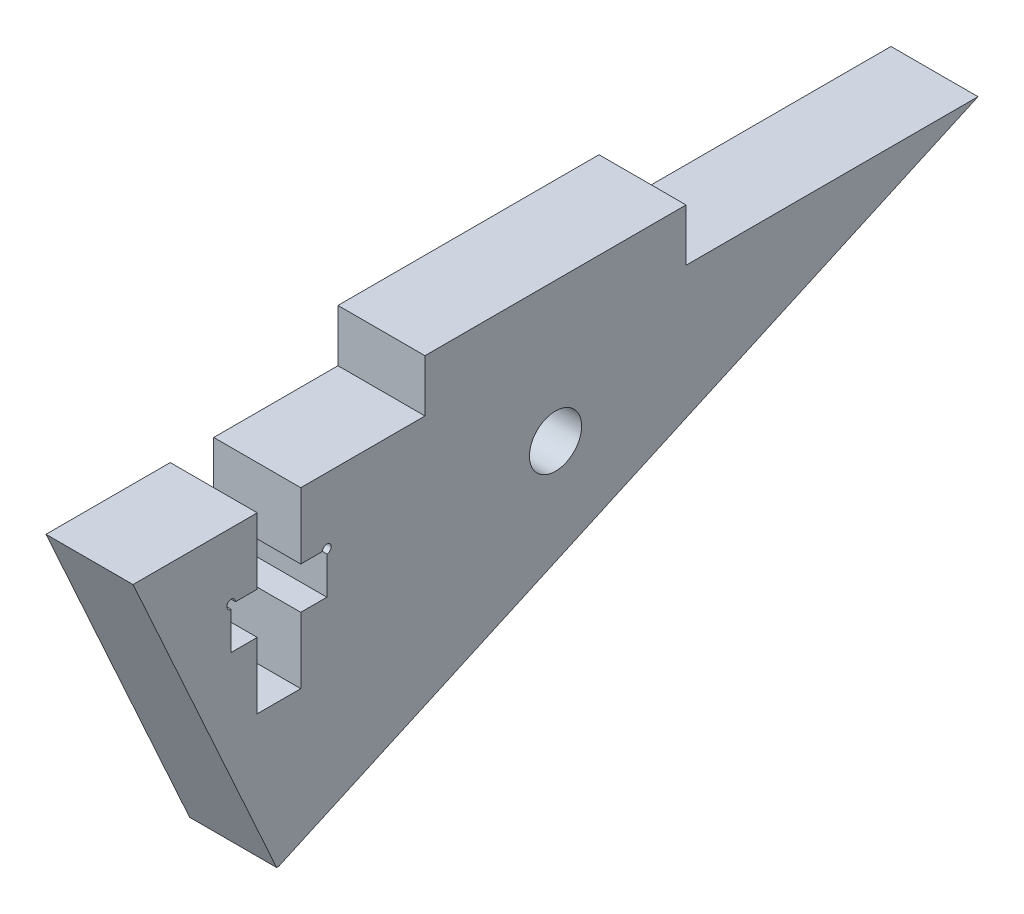
ISO-10303-21;
HEADER;
FILE_DESCRIPTION(('STEP AP214'),'2;1');
FILE_NAME('part.step','',(''),(''),'','','');
FILE_SCHEMA(('AUTOMOTIVE_DESIGN { 1 0 10303 214 1 1 1 1 }'));
ENDSEC;
DATA;
#1=APPLICATION_CONTEXT('core data for automotive mechanical design processes');
#2=APPLICATION_PROTOCOL_DEFINITION('international standard','automotive_design',2000,#1);
#3=PRODUCT_CONTEXT('',#1,'mechanical');
#4=PRODUCT('Part','Part','',(#3));
#5=PRODUCT_RELATED_PRODUCT_CATEGORY('part','',(#4));
#6=PRODUCT_DEFINITION_FORMATION('','',#4);
#7=PRODUCT_DEFINITION_CONTEXT('part definition',#1,'design');
#8=PRODUCT_DEFINITION('design','',#6,#7);
#9=PRODUCT_DEFINITION_SHAPE('','',#8);
#10=(LENGTH_UNIT() NAMED_UNIT(*) SI_UNIT(.MILLI.,.METRE.));
#11=(NAMED_UNIT(*) PLANE_ANGLE_UNIT() SI_UNIT($,.RADIAN.));
#12=(NAMED_UNIT(*) SI_UNIT($,.STERADIAN.) SOLID_ANGLE_UNIT());
#13=UNCERTAINTY_MEASURE_WITH_UNIT(LENGTH_MEASURE(1.E-05),#10,'distance_accuracy_value','');
#14=(GEOMETRIC_REPRESENTATION_CONTEXT(3) GLOBAL_UNCERTAINTY_ASSIGNED_CONTEXT((#13)) GLOBAL_UNIT_ASSIGNED_CONTEXT((#10,
#11,#12)) REPRESENTATION_CONTEXT('',''));
#15=CARTESIAN_POINT('',(0.,0.,0.));
#16=DIRECTION('',(0.,0.,1.));
#17=DIRECTION('',(1.,0.,0.));
#18=AXIS2_PLACEMENT_3D('',#15,#16,#17);
#19=CARTESIAN_POINT('',(5.,9.105,24.275));
#20=DIRECTION('',(0.,-1.,0.));
#21=DIRECTION('',(0.,0.,-1.));
#22=AXIS2_PLACEMENT_3D('',#19,#20,#21);
#23=PLANE('',#22);
#24=DIRECTION('',(-1.,0.,0.));
#25=VECTOR('',#24,1.);
#26=CARTESIAN_POINT('',(5.00005,9.105,14.6375));
#27=LINE('',#26,#25);
#28=CARTESIAN_POINT('',(5.,9.105,14.6375));
#29=VERTEX_POINT('',#28);
#30=CARTESIAN_POINT('',(0.,9.105,14.6375));
#31=VERTEX_POINT('',#30);
#32=EDGE_CURVE('E399',#29,#31,#27,.T.);
#33=ORIENTED_EDGE('',*,*,#32,.F.);
#34=DIRECTION('',(0.,0.,1.));
#35=VECTOR('',#34,1.);
#36=CARTESIAN_POINT('',(5.,9.105,24.275));
#37=LINE('',#36,#35);
#38=CARTESIAN_POINT('',(5.,9.105,7.50000000000001));
#39=VERTEX_POINT('',#38);
#40=EDGE_CURVE('E236',#39,#29,#37,.T.);
#41=ORIENTED_EDGE('',*,*,#40,.F.);
#42=DIRECTION('',(1.,0.,0.));
#43=VECTOR('',#42,1.);
#44=CARTESIAN_POINT('',(0.,9.105,7.50000000000001));
#45=LINE('',#44,#43);
#46=CARTESIAN_POINT('',(0.,9.105,7.50000000000001));
#47=VERTEX_POINT('',#46);
#48=EDGE_CURVE('E216',#47,#39,#45,.T.);
#49=ORIENTED_EDGE('',*,*,#48,.F.);
#50=DIRECTION('',(0.,0.,1.));
#51=VECTOR('',#50,1.);
#52=CARTESIAN_POINT('',(0.,9.105,24.275));
#53=LINE('',#52,#51);
#54=EDGE_CURVE('E264',#47,#31,#53,.T.);
#55=ORIENTED_EDGE('',*,*,#54,.T.);
#56=EDGE_LOOP('',(#33,#41,#49,#55));
#57=FACE_BOUND('',#56,.T.);
#58=ADVANCED_FACE('F35',(#57),#23,.F.);
#59=DIRECTION('',(-1.,0.,0.));
#60=VECTOR('',#59,1.);
#61=CARTESIAN_POINT('',(5.00005,9.105,17.1375));
#62=LINE('',#61,#60);
#63=CARTESIAN_POINT('',(5.,9.105,17.1375));
#64=VERTEX_POINT('',#63);
#65=CARTESIAN_POINT('',(0.,9.105,17.1375));
#66=VERTEX_POINT('',#65);
#67=EDGE_CURVE('E396',#64,#66,#62,.T.);
#68=ORIENTED_EDGE('',*,*,#67,.T.);
#69=CARTESIAN_POINT('',(0.,9.105,24.275));
#70=VERTEX_POINT('',#69);
#71=EDGE_CURVE('E261',#66,#70,#53,.T.);
#72=ORIENTED_EDGE('',*,*,#71,.T.);
#73=DIRECTION('',(-1.,0.,0.));
#74=VECTOR('',#73,1.);
#75=CARTESIAN_POINT('',(5.,9.105,24.275));
#76=LINE('',#75,#74);
#77=CARTESIAN_POINT('',(5.,9.105,24.275));
#78=VERTEX_POINT('',#77);
#79=EDGE_CURVE('E270',#78,#70,#76,.T.);
#80=ORIENTED_EDGE('',*,*,#79,.F.);
#81=EDGE_CURVE('E266',#64,#78,#37,.T.);
#82=ORIENTED_EDGE('',*,*,#81,.F.);
#83=EDGE_LOOP('',(#68,#72,#80,#82));
#84=FACE_BOUND('',#83,.T.);
#85=ADVANCED_FACE('F322',(#84),#23,.F.);
#86=CARTESIAN_POINT('',(5.,0.,0.));
#87=DIRECTION('',(1.,0.,0.));
#88=DIRECTION('',(0.,0.,-1.));
#89=AXIS2_PLACEMENT_3D('',#86,#87,#88);
#90=PLANE('',#89);
#91=CARTESIAN_POINT('',(5.,5.30500000000003,13.1375));
#92=DIRECTION('',(1.,0.,0.));
#93=DIRECTION('',(0.,0.,-1.));
#94=AXIS2_PLACEMENT_3D('',#91,#92,#93);
#95=CIRCLE('',#94,0.25);
#96=CARTESIAN_POINT('',(5.,5.05500000000003,13.1375));
#97=VERTEX_POINT('',#96);
#98=CARTESIAN_POINT('',(5.,5.30500000000003,13.3875));
#99=VERTEX_POINT('',#98);
#100=EDGE_CURVE('E49',#97,#99,#95,.T.);
#101=ORIENTED_EDGE('',*,*,#100,.F.);
#102=DIRECTION('',(0.,-1.,0.));
#103=VECTOR('',#102,1.);
#104=CARTESIAN_POINT('',(5.,0.,13.1375));
#105=LINE('',#104,#103);
#106=CARTESIAN_POINT('',(5.,2.90500000000002,13.1375));
#107=VERTEX_POINT('',#106);
#108=EDGE_CURVE('E195',#97,#107,#105,.T.);
#109=ORIENTED_EDGE('',*,*,#108,.T.);
#110=DIRECTION('',(0.,0.,1.));
#111=VECTOR('',#110,1.);
#112=CARTESIAN_POINT('',(5.,2.90500000000002,0.));
#113=LINE('',#112,#111);
#114=CARTESIAN_POINT('',(5.,2.90500000000002,14.6375));
#115=VERTEX_POINT('',#114);
#116=EDGE_CURVE('E203',#107,#115,#113,.T.);
#117=ORIENTED_EDGE('',*,*,#116,.T.);
#118=DIRECTION('',(0.,-1.,0.));
#119=VECTOR('',#118,1.);
#120=CARTESIAN_POINT('',(5.,0.,14.6375));
#121=LINE('',#120,#119);
#122=CARTESIAN_POINT('',(5.,-0.894999999999983,14.6375));
#123=VERTEX_POINT('',#122);
#124=EDGE_CURVE('E205',#115,#123,#121,.T.);
#125=ORIENTED_EDGE('',*,*,#124,.T.);
#126=DIRECTION('',(0.,0.,1.));
#127=VECTOR('',#126,1.);
#128=CARTESIAN_POINT('',(5.,-0.894999999999977,0.));
#129=LINE('',#128,#127);
#130=CARTESIAN_POINT('',(5.,-0.894999999999983,17.1375));
#131=VERTEX_POINT('',#130);
#132=EDGE_CURVE('E213',#123,#131,#129,.T.);
#133=ORIENTED_EDGE('',*,*,#132,.T.);
#134=DIRECTION('',(0.,1.,0.));
#135=VECTOR('',#134,1.);
#136=CARTESIAN_POINT('',(5.,0.,17.1375));
#137=LINE('',#136,#135);
#138=CARTESIAN_POINT('',(5.,2.90500000000002,17.1375));
#139=VERTEX_POINT('',#138);
#140=EDGE_CURVE('E408',#131,#139,#137,.T.);
#141=ORIENTED_EDGE('',*,*,#140,.T.);
#142=DIRECTION('',(0.,0.,1.));
#143=VECTOR('',#142,1.);
#144=CARTESIAN_POINT('',(5.,2.90500000000002,0.));
#145=LINE('',#144,#143);
#146=CARTESIAN_POINT('',(5.,2.90500000000002,18.6375));
#147=VERTEX_POINT('',#146);
#148=EDGE_CURVE('E411',#139,#147,#145,.T.);
#149=ORIENTED_EDGE('',*,*,#148,.T.);
#150=DIRECTION('',(0.,1.,0.));
#151=VECTOR('',#150,1.);
#152=CARTESIAN_POINT('',(5.,0.,18.6375));
#153=LINE('',#152,#151);
#154=CARTESIAN_POINT('',(5.,5.05500000000002,18.6375));
#155=VERTEX_POINT('',#154);
#156=EDGE_CURVE('E414',#147,#155,#153,.T.);
#157=ORIENTED_EDGE('',*,*,#156,.T.);
#158=CARTESIAN_POINT('',(5.,5.30500000000002,18.6375));
#159=DIRECTION('',(1.,0.,0.));
#160=DIRECTION('',(0.,0.,-1.));
#161=AXIS2_PLACEMENT_3D('',#158,#159,#160);
#162=CIRCLE('',#161,0.25);
#163=CARTESIAN_POINT('',(5.,5.30500000000002,18.3875));
#164=VERTEX_POINT('',#163);
#165=EDGE_CURVE('E57',#164,#155,#162,.T.);
#166=ORIENTED_EDGE('',*,*,#165,.F.);
#167=DIRECTION('',(0.,0.,-1.));
#168=VECTOR('',#167,1.);
#169=CARTESIAN_POINT('',(5.,5.30500000000005,0.));
#170=LINE('',#169,#168);
#171=CARTESIAN_POINT('',(5.,5.30500000000002,17.1375));
#172=VERTEX_POINT('',#171);
#173=EDGE_CURVE('E417',#164,#172,#170,.T.);
#174=ORIENTED_EDGE('',*,*,#173,.T.);
#175=DIRECTION('',(0.,1.,0.));
#176=VECTOR('',#175,1.);
#177=CARTESIAN_POINT('',(5.,0.,17.1375));
#178=LINE('',#177,#176);
#179=EDGE_CURVE('E419',#172,#64,#178,.T.);
#180=ORIENTED_EDGE('',*,*,#179,.T.);
#181=ORIENTED_EDGE('',*,*,#81,.T.);
#182=DIRECTION('',(0.,0.910827805970329,0.412786516096731));
#183=VECTOR('',#182,1.);
#184=CARTESIAN_POINT('',(5.,-9.11155611940658,16.0192696780654));
#185=LINE('',#184,#183);
#186=CARTESIAN_POINT('',(5.,-9.105,16.0222409067337));
#187=VERTEX_POINT('',#186);
#188=EDGE_CURVE('E309',#187,#78,#185,.T.);
#189=ORIENTED_EDGE('',*,*,#188,.F.);
#190=DIRECTION('',(0.,0.,-1.));
#191=VECTOR('',#190,1.);
#192=CARTESIAN_POINT('',(5.,-9.105,24.275));
#193=LINE('',#192,#191);
#194=CARTESIAN_POINT('',(5.,-9.105,15.9059984094364));
#195=VERTEX_POINT('',#194);
#196=EDGE_CURVE('E277',#187,#195,#193,.T.);
#197=ORIENTED_EDGE('',*,*,#196,.T.);
#198=DIRECTION('',(0.,-0.412786516096734,0.910827805970328));
#199=VECTOR('',#198,1.);
#200=CARTESIAN_POINT('',(5.,9.105,-24.275));
#201=LINE('',#200,#199);
#202=CARTESIAN_POINT('',(5.,9.105,-24.275));
#203=VERTEX_POINT('',#202);
#204=EDGE_CURVE('E301',#203,#195,#201,.T.);
#205=ORIENTED_EDGE('',*,*,#204,.F.);
#206=CARTESIAN_POINT('',(5.,9.105,-7.50000000000001));
#207=VERTEX_POINT('',#206);
#208=EDGE_CURVE('E284',#203,#207,#37,.T.);
#209=ORIENTED_EDGE('',*,*,#208,.T.);
#210=DIRECTION('',(0.,-1.,0.));
#211=VECTOR('',#210,1.);
#212=CARTESIAN_POINT('',(4.99999999999999,12.105,-7.50000000000001));
#213=LINE('',#212,#211);
#214=CARTESIAN_POINT('',(4.99999999999999,12.105,-7.50000000000001));
#215=VERTEX_POINT('',#214);
#216=EDGE_CURVE('E243',#215,#207,#213,.T.);
#217=ORIENTED_EDGE('',*,*,#216,.F.);
#218=DIRECTION('',(0.,0.,-1.));
#219=VECTOR('',#218,1.);
#220=CARTESIAN_POINT('',(4.99999999999999,12.105,-7.50000000000001));
#221=LINE('',#220,#219);
#222=CARTESIAN_POINT('',(5.,12.105,7.50000000000001));
#223=VERTEX_POINT('',#222);
#224=EDGE_CURVE('E223',#223,#215,#221,.T.);
#225=ORIENTED_EDGE('',*,*,#224,.F.);
#226=DIRECTION('',(0.,-1.,0.));
#227=VECTOR('',#226,1.);
#228=CARTESIAN_POINT('',(5.,12.105,7.50000000000001));
#229=LINE('',#228,#227);
#230=EDGE_CURVE('E239',#223,#39,#229,.T.);
#231=ORIENTED_EDGE('',*,*,#230,.T.);
#232=ORIENTED_EDGE('',*,*,#40,.T.);
#233=DIRECTION('',(0.,-1.,0.));
#234=VECTOR('',#233,1.);
#235=CARTESIAN_POINT('',(5.,0.,14.6375));
#236=LINE('',#235,#234);
#237=CARTESIAN_POINT('',(5.,5.30500000000002,14.6375));
#238=VERTEX_POINT('',#237);
#239=EDGE_CURVE('E207',#29,#238,#236,.T.);
#240=ORIENTED_EDGE('',*,*,#239,.T.);
#241=DIRECTION('',(0.,0.,-1.));
#242=VECTOR('',#241,1.);
#243=CARTESIAN_POINT('',(5.,5.30500000000006,0.));
#244=LINE('',#243,#242);
#245=EDGE_CURVE('E198',#238,#99,#244,.T.);
#246=ORIENTED_EDGE('',*,*,#245,.T.);
#247=EDGE_LOOP('',(#101,#109,#117,#125,#133,#141,#149,#157,#166,#174,#180,#181,#189,#197,#205,
#209,#217,#225,#231,#232,#240,#246));
#248=FACE_BOUND('',#247,.T.);
#249=CARTESIAN_POINT('',(5.,4.10500000000001,0.));
#250=DIRECTION('',(1.,0.,0.));
#251=DIRECTION('',(0.,0.,-1.));
#252=AXIS2_PLACEMENT_3D('',#249,#250,#251);
#253=CIRCLE('',#252,1.5);
#254=CARTESIAN_POINT('',(5.,4.10500000000001,-1.5));
#255=VERTEX_POINT('',#254);
#256=EDGE_CURVE('E312',#255,#255,#253,.T.);
#257=ORIENTED_EDGE('',*,*,#256,.F.);
#258=EDGE_LOOP('',(#257));
#259=FACE_BOUND('',#258,.T.);
#260=ADVANCED_FACE('F192',(#248,#259),#90,.T.);
#261=CARTESIAN_POINT('',(0.,0.,0.));
#262=DIRECTION('',(1.,0.,0.));
#263=DIRECTION('',(0.,0.,-1.));
#264=AXIS2_PLACEMENT_3D('',#261,#262,#263);
#265=PLANE('',#264);
#266=CARTESIAN_POINT('',(0.,4.10500000000001,0.));
#267=DIRECTION('',(1.,0.,0.));
#268=DIRECTION('',(0.,0.,-1.));
#269=AXIS2_PLACEMENT_3D('',#266,#267,#268);
#270=CIRCLE('',#269,1.5);
#271=CARTESIAN_POINT('',(0.,4.10500000000001,-1.5));
#272=VERTEX_POINT('',#271);
#273=EDGE_CURVE('E248',#272,#272,#270,.T.);
#274=ORIENTED_EDGE('',*,*,#273,.T.);
#275=EDGE_LOOP('',(#274));
#276=FACE_BOUND('',#275,.T.);
#277=DIRECTION('',(0.,1.,0.));
#278=VECTOR('',#277,1.);
#279=CARTESIAN_POINT('',(0.,5.30500000000003,13.1375));
#280=LINE('',#279,#278);
#281=CARTESIAN_POINT('',(0.,2.90500000000002,13.1375));
#282=VERTEX_POINT('',#281);
#283=CARTESIAN_POINT('',(0.,5.05500000000003,13.1375));
#284=VERTEX_POINT('',#283);
#285=EDGE_CURVE('E372',#282,#284,#280,.T.);
#286=ORIENTED_EDGE('',*,*,#285,.T.);
#287=CARTESIAN_POINT('',(0.,5.30500000000003,13.1375));
#288=DIRECTION('',(1.,0.,0.));
#289=DIRECTION('',(0.,0.,-1.));
#290=AXIS2_PLACEMENT_3D('',#287,#288,#289);
#291=CIRCLE('',#290,0.25);
#292=CARTESIAN_POINT('',(0.,5.30500000000003,13.3875));
#293=VERTEX_POINT('',#292);
#294=EDGE_CURVE('E184',#284,#293,#291,.T.);
#295=ORIENTED_EDGE('',*,*,#294,.T.);
#296=DIRECTION('',(0.,0.,1.));
#297=VECTOR('',#296,1.);
#298=CARTESIAN_POINT('',(0.,5.30500000000002,14.6375));
#299=LINE('',#298,#297);
#300=CARTESIAN_POINT('',(0.,5.30500000000002,14.6375));
#301=VERTEX_POINT('',#300);
#302=EDGE_CURVE('E363',#293,#301,#299,.T.);
#303=ORIENTED_EDGE('',*,*,#302,.T.);
#304=DIRECTION('',(0.,1.,0.));
#305=VECTOR('',#304,1.);
#306=CARTESIAN_POINT('',(0.,9.105,14.6375));
#307=LINE('',#306,#305);
#308=EDGE_CURVE('E361',#301,#31,#307,.T.);
#309=ORIENTED_EDGE('',*,*,#308,.T.);
#310=ORIENTED_EDGE('',*,*,#54,.F.);
#311=DIRECTION('',(0.,-1.,0.));
#312=VECTOR('',#311,1.);
#313=CARTESIAN_POINT('',(0.,12.105,7.50000000000001));
#314=LINE('',#313,#312);
#315=CARTESIAN_POINT('',(0.,12.105,7.50000000000001));
#316=VERTEX_POINT('',#315);
#317=EDGE_CURVE('E242',#316,#47,#314,.T.);
#318=ORIENTED_EDGE('',*,*,#317,.F.);
#319=DIRECTION('',(0.,0.,1.));
#320=VECTOR('',#319,1.);
#321=CARTESIAN_POINT('',(0.,12.105,-7.50000000000001));
#322=LINE('',#321,#320);
#323=CARTESIAN_POINT('',(0.,12.105,-7.50000000000001));
#324=VERTEX_POINT('',#323);
#325=EDGE_CURVE('E217',#324,#316,#322,.T.);
#326=ORIENTED_EDGE('',*,*,#325,.F.);
#327=DIRECTION('',(0.,-1.,0.));
#328=VECTOR('',#327,1.);
#329=CARTESIAN_POINT('',(0.,12.105,-7.50000000000001));
#330=LINE('',#329,#328);
#331=CARTESIAN_POINT('',(0.,9.105,-7.50000000000001));
#332=VERTEX_POINT('',#331);
#333=EDGE_CURVE('E227',#324,#332,#330,.T.);
#334=ORIENTED_EDGE('',*,*,#333,.T.);
#335=CARTESIAN_POINT('',(0.,9.105,-24.275));
#336=VERTEX_POINT('',#335);
#337=EDGE_CURVE('E276',#336,#332,#53,.T.);
#338=ORIENTED_EDGE('',*,*,#337,.F.);
#339=DIRECTION('',(0.,-0.412786516096734,0.910827805970328));
#340=VECTOR('',#339,1.);
#341=CARTESIAN_POINT('',(0.,9.105,-24.275));
#342=LINE('',#341,#340);
#343=CARTESIAN_POINT('',(0.,-9.105,15.9059984094364));
#344=VERTEX_POINT('',#343);
#345=EDGE_CURVE('E302',#336,#344,#342,.T.);
#346=ORIENTED_EDGE('',*,*,#345,.T.);
#347=DIRECTION('',(0.,0.,-1.));
#348=VECTOR('',#347,1.);
#349=CARTESIAN_POINT('',(0.,-9.105,24.275));
#350=LINE('',#349,#348);
#351=CARTESIAN_POINT('',(0.,-9.105,16.0222409067337));
#352=VERTEX_POINT('',#351);
#353=EDGE_CURVE('E265',#352,#344,#350,.T.);
#354=ORIENTED_EDGE('',*,*,#353,.F.);
#355=DIRECTION('',(0.,0.910827805970329,0.412786516096731));
#356=VECTOR('',#355,1.);
#357=CARTESIAN_POINT('',(0.,-9.11155611940658,16.0192696780654));
#358=LINE('',#357,#356);
#359=EDGE_CURVE('E310',#352,#70,#358,.T.);
#360=ORIENTED_EDGE('',*,*,#359,.T.);
#361=ORIENTED_EDGE('',*,*,#71,.F.);
#362=DIRECTION('',(0.,-1.,0.));
#363=VECTOR('',#362,1.);
#364=CARTESIAN_POINT('',(0.,5.30500000000002,17.1375));
#365=LINE('',#364,#363);
#366=CARTESIAN_POINT('',(0.,5.30500000000002,17.1375));
#367=VERTEX_POINT('',#366);
#368=EDGE_CURVE('E367',#66,#367,#365,.T.);
#369=ORIENTED_EDGE('',*,*,#368,.T.);
#370=DIRECTION('',(0.,0.,1.));
#371=VECTOR('',#370,1.);
#372=CARTESIAN_POINT('',(0.,5.30500000000002,18.6375));
#373=LINE('',#372,#371);
#374=CARTESIAN_POINT('',(0.,5.30500000000002,18.3875));
#375=VERTEX_POINT('',#374);
#376=EDGE_CURVE('E370',#367,#375,#373,.T.);
#377=ORIENTED_EDGE('',*,*,#376,.T.);
#378=CARTESIAN_POINT('',(0.,5.30500000000002,18.6375));
#379=DIRECTION('',(1.,0.,0.));
#380=DIRECTION('',(0.,0.,-1.));
#381=AXIS2_PLACEMENT_3D('',#378,#379,#380);
#382=CIRCLE('',#381,0.25);
#383=CARTESIAN_POINT('',(0.,5.05500000000002,18.6375));
#384=VERTEX_POINT('',#383);
#385=EDGE_CURVE('E428',#375,#384,#382,.T.);
#386=ORIENTED_EDGE('',*,*,#385,.T.);
#387=DIRECTION('',(0.,-1.,0.));
#388=VECTOR('',#387,1.);
#389=CARTESIAN_POINT('',(0.,2.90500000000002,18.6375));
#390=LINE('',#389,#388);
#391=CARTESIAN_POINT('',(0.,2.90500000000002,18.6375));
#392=VERTEX_POINT('',#391);
#393=EDGE_CURVE('E378',#384,#392,#390,.T.);
#394=ORIENTED_EDGE('',*,*,#393,.T.);
#395=DIRECTION('',(0.,0.,-1.));
#396=VECTOR('',#395,1.);
#397=CARTESIAN_POINT('',(0.,2.90500000000002,17.1375));
#398=LINE('',#397,#396);
#399=CARTESIAN_POINT('',(0.,2.90500000000002,17.1375));
#400=VERTEX_POINT('',#399);
#401=EDGE_CURVE('E380',#392,#400,#398,.T.);
#402=ORIENTED_EDGE('',*,*,#401,.T.);
#403=DIRECTION('',(0.,-1.,0.));
#404=VECTOR('',#403,1.);
#405=CARTESIAN_POINT('',(0.,-0.894999999999983,17.1375));
#406=LINE('',#405,#404);
#407=CARTESIAN_POINT('',(0.,-0.894999999999983,17.1375));
#408=VERTEX_POINT('',#407);
#409=EDGE_CURVE('E383',#400,#408,#406,.T.);
#410=ORIENTED_EDGE('',*,*,#409,.T.);
#411=DIRECTION('',(0.,0.,-1.));
#412=VECTOR('',#411,1.);
#413=CARTESIAN_POINT('',(0.,-0.894999999999983,14.6375));
#414=LINE('',#413,#412);
#415=CARTESIAN_POINT('',(0.,-0.894999999999983,14.6375));
#416=VERTEX_POINT('',#415);
#417=EDGE_CURVE('E433',#408,#416,#414,.T.);
#418=ORIENTED_EDGE('',*,*,#417,.T.);
#419=DIRECTION('',(0.,1.,0.));
#420=VECTOR('',#419,1.);
#421=CARTESIAN_POINT('',(0.,2.90500000000002,14.6375));
#422=LINE('',#421,#420);
#423=CARTESIAN_POINT('',(0.,2.90500000000002,14.6375));
#424=VERTEX_POINT('',#423);
#425=EDGE_CURVE('E436',#416,#424,#422,.T.);
#426=ORIENTED_EDGE('',*,*,#425,.T.);
#427=DIRECTION('',(0.,0.,-1.));
#428=VECTOR('',#427,1.);
#429=CARTESIAN_POINT('',(0.,2.90500000000002,13.1375));
#430=LINE('',#429,#428);
#431=EDGE_CURVE('E439',#424,#282,#430,.T.);
#432=ORIENTED_EDGE('',*,*,#431,.T.);
#433=EDGE_LOOP('',(#286,#295,#303,#309,#310,#318,#326,#334,#338,#346,#354,#360,#361,#369,#377,
#386,#394,#402,#410,#418,#426,#432));
#434=FACE_BOUND('',#433,.T.);
#435=ADVANCED_FACE('F321',(#276,#434),#265,.F.);
#436=DIRECTION('',(-1.,0.,0.));
#437=VECTOR('',#436,1.);
#438=CARTESIAN_POINT('',(0.,9.105,-7.50000000000001));
#439=LINE('',#438,#437);
#440=EDGE_CURVE('E221',#207,#332,#439,.T.);
#441=ORIENTED_EDGE('',*,*,#440,.F.);
#442=ORIENTED_EDGE('',*,*,#208,.F.);
#443=DIRECTION('',(-1.,0.,0.));
#444=VECTOR('',#443,1.);
#445=CARTESIAN_POINT('',(5.,9.105,-24.275));
#446=LINE('',#445,#444);
#447=EDGE_CURVE('E278',#203,#336,#446,.T.);
#448=ORIENTED_EDGE('',*,*,#447,.T.);
#449=ORIENTED_EDGE('',*,*,#337,.T.);
#450=EDGE_LOOP('',(#441,#442,#448,#449));
#451=FACE_BOUND('',#450,.T.);
#452=ADVANCED_FACE('F328',(#451),#23,.F.);
#453=CARTESIAN_POINT('',(5.,-9.105,24.275));
#454=DIRECTION('',(0.,1.,0.));
#455=DIRECTION('',(0.,0.,1.));
#456=AXIS2_PLACEMENT_3D('',#453,#454,#455);
#457=PLANE('',#456);
#458=DIRECTION('',(1.,0.,0.));
#459=VECTOR('',#458,1.);
#460=CARTESIAN_POINT('',(5.,-9.105,16.0222409067337));
#461=LINE('',#460,#459);
#462=EDGE_CURVE('E305',#352,#187,#461,.T.);
#463=ORIENTED_EDGE('',*,*,#462,.F.);
#464=ORIENTED_EDGE('',*,*,#353,.T.);
#465=DIRECTION('',(-1.,0.,0.));
#466=VECTOR('',#465,1.);
#467=CARTESIAN_POINT('',(5.,-9.105,15.9059984094364));
#468=LINE('',#467,#466);
#469=EDGE_CURVE('E298',#195,#344,#468,.T.);
#470=ORIENTED_EDGE('',*,*,#469,.F.);
#471=ORIENTED_EDGE('',*,*,#196,.F.);
#472=EDGE_LOOP('',(#463,#464,#470,#471));
#473=FACE_BOUND('',#472,.T.);
#474=ADVANCED_FACE('F37',(#473),#457,.F.);
#475=CARTESIAN_POINT('',(5.,9.105,-24.275));
#476=DIRECTION('',(0.,-0.910827805970328,-0.412786516096734));
#477=DIRECTION('',(0.,0.412786516096734,-0.910827805970328));
#478=AXIS2_PLACEMENT_3D('',#475,#476,#477);
#479=PLANE('',#478);
#480=ORIENTED_EDGE('',*,*,#345,.F.);
#481=ORIENTED_EDGE('',*,*,#447,.F.);
#482=ORIENTED_EDGE('',*,*,#204,.T.);
#483=ORIENTED_EDGE('',*,*,#469,.T.);
#484=EDGE_LOOP('',(#480,#481,#482,#483));
#485=FACE_BOUND('',#484,.T.);
#486=ADVANCED_FACE('F342',(#485),#479,.T.);
#487=CARTESIAN_POINT('',(5.,-9.11155611940658,16.0192696780654));
#488=DIRECTION('',(0.,-0.412786516096731,0.910827805970329));
#489=DIRECTION('',(0.,-0.910827805970329,-0.412786516096731));
#490=AXIS2_PLACEMENT_3D('',#487,#488,#489);
#491=PLANE('',#490);
#492=ORIENTED_EDGE('',*,*,#462,.T.);
#493=ORIENTED_EDGE('',*,*,#188,.T.);
#494=ORIENTED_EDGE('',*,*,#79,.T.);
#495=ORIENTED_EDGE('',*,*,#359,.F.);
#496=EDGE_LOOP('',(#492,#493,#494,#495));
#497=FACE_BOUND('',#496,.T.);
#498=ADVANCED_FACE('F476',(#497),#491,.T.);
#499=CARTESIAN_POINT('',(5.,4.10500000000001,0.));
#500=DIRECTION('',(-1.,0.,0.));
#501=DIRECTION('',(0.,0.,1.));
#502=AXIS2_PLACEMENT_3D('',#499,#500,#501);
#503=CYLINDRICAL_SURFACE('',#502,1.5);
#504=ORIENTED_EDGE('',*,*,#256,.T.);
#505=EDGE_LOOP('',(#504));
#506=FACE_BOUND('',#505,.T.);
#507=ORIENTED_EDGE('',*,*,#273,.F.);
#508=EDGE_LOOP('',(#507));
#509=FACE_BOUND('',#508,.T.);
#510=ADVANCED_FACE('F318',(#506,#509),#503,.F.);
#511=CARTESIAN_POINT('',(0.,12.105,7.50000000000001));
#512=DIRECTION('',(0.,0.,-1.));
#513=DIRECTION('',(-1.,0.,0.));
#514=AXIS2_PLACEMENT_3D('',#511,#512,#513);
#515=PLANE('',#514);
#516=ORIENTED_EDGE('',*,*,#48,.T.);
#517=ORIENTED_EDGE('',*,*,#230,.F.);
#518=DIRECTION('',(1.,0.,0.));
#519=VECTOR('',#518,1.);
#520=CARTESIAN_POINT('',(0.,12.105,7.50000000000001));
#521=LINE('',#520,#519);
#522=EDGE_CURVE('E220',#316,#223,#521,.T.);
#523=ORIENTED_EDGE('',*,*,#522,.F.);
#524=ORIENTED_EDGE('',*,*,#317,.T.);
#525=EDGE_LOOP('',(#516,#517,#523,#524));
#526=FACE_BOUND('',#525,.T.);
#527=ADVANCED_FACE('F357',(#526),#515,.F.);
#528=CARTESIAN_POINT('',(0.,12.105,-7.50000000000001));
#529=DIRECTION('',(0.,0.,1.));
#530=DIRECTION('',(1.,0.,0.));
#531=AXIS2_PLACEMENT_3D('',#528,#529,#530);
#532=PLANE('',#531);
#533=ORIENTED_EDGE('',*,*,#440,.T.);
#534=ORIENTED_EDGE('',*,*,#333,.F.);
#535=DIRECTION('',(-1.,0.,0.));
#536=VECTOR('',#535,1.);
#537=CARTESIAN_POINT('',(0.,12.105,-7.50000000000001));
#538=LINE('',#537,#536);
#539=EDGE_CURVE('E225',#215,#324,#538,.T.);
#540=ORIENTED_EDGE('',*,*,#539,.F.);
#541=ORIENTED_EDGE('',*,*,#216,.T.);
#542=EDGE_LOOP('',(#533,#534,#540,#541));
#543=FACE_BOUND('',#542,.T.);
#544=ADVANCED_FACE('F346',(#543),#532,.F.);
#545=CARTESIAN_POINT('',(0.,12.105,0.));
#546=DIRECTION('',(0.,1.,0.));
#547=DIRECTION('',(0.,0.,1.));
#548=AXIS2_PLACEMENT_3D('',#545,#546,#547);
#549=PLANE('',#548);
#550=ORIENTED_EDGE('',*,*,#325,.T.);
#551=ORIENTED_EDGE('',*,*,#522,.T.);
#552=ORIENTED_EDGE('',*,*,#224,.T.);
#553=ORIENTED_EDGE('',*,*,#539,.T.);
#554=EDGE_LOOP('',(#550,#551,#552,#553));
#555=FACE_BOUND('',#554,.T.);
#556=ADVANCED_FACE('F353',(#555),#549,.T.);
#557=CARTESIAN_POINT('',(5.00005,-0.894999999999983,14.6375));
#558=DIRECTION('',(0.,1.,0.));
#559=DIRECTION('',(0.,0.,1.));
#560=AXIS2_PLACEMENT_3D('',#557,#558,#559);
#561=PLANE('',#560);
#562=DIRECTION('',(-1.,0.,0.));
#563=VECTOR('',#562,1.);
#564=CARTESIAN_POINT('',(5.00005,-0.894999999999983,14.6375));
#565=LINE('',#564,#563);
#566=EDGE_CURVE('E406',#123,#416,#565,.T.);
#567=ORIENTED_EDGE('',*,*,#566,.T.);
#568=ORIENTED_EDGE('',*,*,#417,.F.);
#569=DIRECTION('',(-1.,0.,0.));
#570=VECTOR('',#569,1.);
#571=CARTESIAN_POINT('',(5.00005,-0.894999999999983,17.1375));
#572=LINE('',#571,#570);
#573=EDGE_CURVE('E386',#131,#408,#572,.T.);
#574=ORIENTED_EDGE('',*,*,#573,.F.);
#575=ORIENTED_EDGE('',*,*,#132,.F.);
#576=EDGE_LOOP('',(#567,#568,#574,#575));
#577=FACE_BOUND('',#576,.T.);
#578=ADVANCED_FACE('F449',(#577),#561,.T.);
#579=CARTESIAN_POINT('',(5.00005,2.90500000000002,14.6375));
#580=DIRECTION('',(0.,0.,1.));
#581=DIRECTION('',(1.,0.,0.));
#582=AXIS2_PLACEMENT_3D('',#579,#580,#581);
#583=PLANE('',#582);
#584=DIRECTION('',(-1.,0.,0.));
#585=VECTOR('',#584,1.);
#586=CARTESIAN_POINT('',(5.00005,2.90500000000002,14.6375));
#587=LINE('',#586,#585);
#588=EDGE_CURVE('E404',#115,#424,#587,.T.);
#589=ORIENTED_EDGE('',*,*,#588,.T.);
#590=ORIENTED_EDGE('',*,*,#425,.F.);
#591=ORIENTED_EDGE('',*,*,#566,.F.);
#592=ORIENTED_EDGE('',*,*,#124,.F.);
#593=EDGE_LOOP('',(#589,#590,#591,#592));
#594=FACE_BOUND('',#593,.T.);
#595=ADVANCED_FACE('F447',(#594),#583,.T.);
#596=CARTESIAN_POINT('',(5.00005,2.90500000000002,13.1375));
#597=DIRECTION('',(0.,1.,0.));
#598=DIRECTION('',(0.,0.,1.));
#599=AXIS2_PLACEMENT_3D('',#596,#597,#598);
#600=PLANE('',#599);
#601=DIRECTION('',(-1.,0.,0.));
#602=VECTOR('',#601,1.);
#603=CARTESIAN_POINT('',(5.00005,2.90500000000002,13.1375));
#604=LINE('',#603,#602);
#605=EDGE_CURVE('E202',#107,#282,#604,.T.);
#606=ORIENTED_EDGE('',*,*,#605,.T.);
#607=ORIENTED_EDGE('',*,*,#431,.F.);
#608=ORIENTED_EDGE('',*,*,#588,.F.);
#609=ORIENTED_EDGE('',*,*,#116,.F.);
#610=EDGE_LOOP('',(#606,#607,#608,#609));
#611=FACE_BOUND('',#610,.T.);
#612=ADVANCED_FACE('F444',(#611),#600,.T.);
#613=CARTESIAN_POINT('',(5.00005,5.30500000000003,13.1375));
#614=DIRECTION('',(0.,0.,1.));
#615=DIRECTION('',(1.,0.,0.));
#616=AXIS2_PLACEMENT_3D('',#613,#614,#615);
#617=PLANE('',#616);
#618=DIRECTION('',(1.,0.,0.));
#619=VECTOR('',#618,1.);
#620=CARTESIAN_POINT('',(-4.99999999997031E-05,5.05500000000003,13.1375));
#621=LINE('',#620,#619);
#622=EDGE_CURVE('E181',#284,#97,#621,.T.);
#623=ORIENTED_EDGE('',*,*,#622,.F.);
#624=ORIENTED_EDGE('',*,*,#285,.F.);
#625=ORIENTED_EDGE('',*,*,#605,.F.);
#626=ORIENTED_EDGE('',*,*,#108,.F.);
#627=EDGE_LOOP('',(#623,#624,#625,#626));
#628=FACE_BOUND('',#627,.T.);
#629=ADVANCED_FACE('F201',(#628),#617,.T.);
#630=CARTESIAN_POINT('',(5.00005,5.30500000000002,14.6375));
#631=DIRECTION('',(0.,-1.,0.));
#632=DIRECTION('',(0.,0.,-1.));
#633=AXIS2_PLACEMENT_3D('',#630,#631,#632);
#634=PLANE('',#633);
#635=DIRECTION('',(1.,0.,0.));
#636=VECTOR('',#635,1.);
#637=CARTESIAN_POINT('',(-4.99999999997031E-05,5.30500000000003,13.3875));
#638=LINE('',#637,#636);
#639=EDGE_CURVE('E11',#99,#293,#638,.F.);
#640=ORIENTED_EDGE('',*,*,#639,.F.);
#641=ORIENTED_EDGE('',*,*,#245,.F.);
#642=DIRECTION('',(-1.,0.,0.));
#643=VECTOR('',#642,1.);
#644=CARTESIAN_POINT('',(5.00005,5.30500000000002,14.6375));
#645=LINE('',#644,#643);
#646=EDGE_CURVE('E401',#238,#301,#645,.T.);
#647=ORIENTED_EDGE('',*,*,#646,.T.);
#648=ORIENTED_EDGE('',*,*,#302,.F.);
#649=EDGE_LOOP('',(#640,#641,#647,#648));
#650=FACE_BOUND('',#649,.T.);
#651=ADVANCED_FACE('F423',(#650),#634,.T.);
#652=CARTESIAN_POINT('',(5.00005,9.105,14.6375));
#653=DIRECTION('',(0.,0.,1.));
#654=DIRECTION('',(1.,0.,0.));
#655=AXIS2_PLACEMENT_3D('',#652,#653,#654);
#656=PLANE('',#655);
#657=ORIENTED_EDGE('',*,*,#32,.T.);
#658=ORIENTED_EDGE('',*,*,#308,.F.);
#659=ORIENTED_EDGE('',*,*,#646,.F.);
#660=ORIENTED_EDGE('',*,*,#239,.F.);
#661=EDGE_LOOP('',(#657,#658,#659,#660));
#662=FACE_BOUND('',#661,.T.);
#663=ADVANCED_FACE('F421',(#662),#656,.T.);
#664=CARTESIAN_POINT('',(5.00005,5.30500000000002,17.1375));
#665=DIRECTION('',(0.,0.,-1.));
#666=DIRECTION('',(-1.,0.,0.));
#667=AXIS2_PLACEMENT_3D('',#664,#665,#666);
#668=PLANE('',#667);
#669=DIRECTION('',(-1.,0.,0.));
#670=VECTOR('',#669,1.);
#671=CARTESIAN_POINT('',(5.00005,5.30500000000002,17.1375));
#672=LINE('',#671,#670);
#673=EDGE_CURVE('E394',#172,#367,#672,.T.);
#674=ORIENTED_EDGE('',*,*,#673,.T.);
#675=ORIENTED_EDGE('',*,*,#368,.F.);
#676=ORIENTED_EDGE('',*,*,#67,.F.);
#677=ORIENTED_EDGE('',*,*,#179,.F.);
#678=EDGE_LOOP('',(#674,#675,#676,#677));
#679=FACE_BOUND('',#678,.T.);
#680=ADVANCED_FACE('F473',(#679),#668,.T.);
#681=CARTESIAN_POINT('',(5.00005,5.30500000000002,18.6375));
#682=DIRECTION('',(0.,-1.,0.));
#683=DIRECTION('',(0.,0.,-1.));
#684=AXIS2_PLACEMENT_3D('',#681,#682,#683);
#685=PLANE('',#684);
#686=DIRECTION('',(1.,0.,0.));
#687=VECTOR('',#686,1.);
#688=CARTESIAN_POINT('',(-4.99999999997031E-05,5.30500000000002,18.3875));
#689=LINE('',#688,#687);
#690=EDGE_CURVE('E431',#375,#164,#689,.T.);
#691=ORIENTED_EDGE('',*,*,#690,.F.);
#692=ORIENTED_EDGE('',*,*,#376,.F.);
#693=ORIENTED_EDGE('',*,*,#673,.F.);
#694=ORIENTED_EDGE('',*,*,#173,.F.);
#695=EDGE_LOOP('',(#691,#692,#693,#694));
#696=FACE_BOUND('',#695,.T.);
#697=ADVANCED_FACE('F469',(#696),#685,.T.);
#698=CARTESIAN_POINT('',(5.00005,2.90500000000002,18.6375));
#699=DIRECTION('',(0.,0.,-1.));
#700=DIRECTION('',(-1.,0.,0.));
#701=AXIS2_PLACEMENT_3D('',#698,#699,#700);
#702=PLANE('',#701);
#703=DIRECTION('',(1.,0.,0.));
#704=VECTOR('',#703,1.);
#705=CARTESIAN_POINT('',(-4.99999999997031E-05,5.05500000000002,18.6375));
#706=LINE('',#705,#704);
#707=EDGE_CURVE('E43',#155,#384,#706,.F.);
#708=ORIENTED_EDGE('',*,*,#707,.F.);
#709=ORIENTED_EDGE('',*,*,#156,.F.);
#710=DIRECTION('',(-1.,0.,0.));
#711=VECTOR('',#710,1.);
#712=CARTESIAN_POINT('',(5.00005,2.90500000000002,18.6375));
#713=LINE('',#712,#711);
#714=EDGE_CURVE('E391',#147,#392,#713,.T.);
#715=ORIENTED_EDGE('',*,*,#714,.T.);
#716=ORIENTED_EDGE('',*,*,#393,.F.);
#717=EDGE_LOOP('',(#708,#709,#715,#716));
#718=FACE_BOUND('',#717,.T.);
#719=ADVANCED_FACE('F462',(#718),#702,.T.);
#720=CARTESIAN_POINT('',(5.00005,2.90500000000002,17.1375));
#721=DIRECTION('',(0.,1.,0.));
#722=DIRECTION('',(0.,0.,1.));
#723=AXIS2_PLACEMENT_3D('',#720,#721,#722);
#724=PLANE('',#723);
#725=DIRECTION('',(-1.,0.,0.));
#726=VECTOR('',#725,1.);
#727=CARTESIAN_POINT('',(5.00005,2.90500000000002,17.1375));
#728=LINE('',#727,#726);
#729=EDGE_CURVE('E389',#139,#400,#728,.T.);
#730=ORIENTED_EDGE('',*,*,#729,.T.);
#731=ORIENTED_EDGE('',*,*,#401,.F.);
#732=ORIENTED_EDGE('',*,*,#714,.F.);
#733=ORIENTED_EDGE('',*,*,#148,.F.);
#734=EDGE_LOOP('',(#730,#731,#732,#733));
#735=FACE_BOUND('',#734,.T.);
#736=ADVANCED_FACE('F459',(#735),#724,.T.);
#737=CARTESIAN_POINT('',(5.00005,-0.894999999999983,17.1375));
#738=DIRECTION('',(0.,0.,-1.));
#739=DIRECTION('',(-1.,0.,0.));
#740=AXIS2_PLACEMENT_3D('',#737,#738,#739);
#741=PLANE('',#740);
#742=ORIENTED_EDGE('',*,*,#573,.T.);
#743=ORIENTED_EDGE('',*,*,#409,.F.);
#744=ORIENTED_EDGE('',*,*,#729,.F.);
#745=ORIENTED_EDGE('',*,*,#140,.F.);
#746=EDGE_LOOP('',(#742,#743,#744,#745));
#747=FACE_BOUND('',#746,.T.);
#748=ADVANCED_FACE('F453',(#747),#741,.T.);
#749=CARTESIAN_POINT('',(-4.99999999997031E-05,5.30500000000002,18.6375));
#750=DIRECTION('',(1.,0.,0.));
#751=DIRECTION('',(0.,0.,-1.));
#752=AXIS2_PLACEMENT_3D('',#749,#750,#751);
#753=CYLINDRICAL_SURFACE('',#752,0.25);
#754=ORIENTED_EDGE('',*,*,#690,.T.);
#755=ORIENTED_EDGE('',*,*,#165,.T.);
#756=ORIENTED_EDGE('',*,*,#707,.T.);
#757=ORIENTED_EDGE('',*,*,#385,.F.);
#758=EDGE_LOOP('',(#754,#755,#756,#757));
#759=FACE_BOUND('',#758,.T.);
#760=ADVANCED_FACE('F463',(#759),#753,.F.);
#761=CARTESIAN_POINT('',(-4.99999999997031E-05,5.30500000000003,13.1375));
#762=DIRECTION('',(1.,0.,0.));
#763=DIRECTION('',(0.,0.,-1.));
#764=AXIS2_PLACEMENT_3D('',#761,#762,#763);
#765=CYLINDRICAL_SURFACE('',#764,0.25);
#766=ORIENTED_EDGE('',*,*,#622,.T.);
#767=ORIENTED_EDGE('',*,*,#100,.T.);
#768=ORIENTED_EDGE('',*,*,#639,.T.);
#769=ORIENTED_EDGE('',*,*,#294,.F.);
#770=EDGE_LOOP('',(#766,#767,#768,#769));
#771=FACE_BOUND('',#770,.T.);
#772=ADVANCED_FACE('F182',(#771),#765,.F.);
#773=CLOSED_SHELL('',(#58,#85,#260,#435,#452,#474,#486,#498,#510,#527,#544,#556,#578,#595,#612,
#629,#651,#663,#680,#697,#719,#736,#748,#760,#772));
#774=MANIFOLD_SOLID_BREP('B2',#773);
#775=ADVANCED_BREP_SHAPE_REPRESENTATION('',(#18,#774),#14);
#776=SHAPE_DEFINITION_REPRESENTATION(#9,#775);
ENDSEC;
END-ISO-10303-21;
